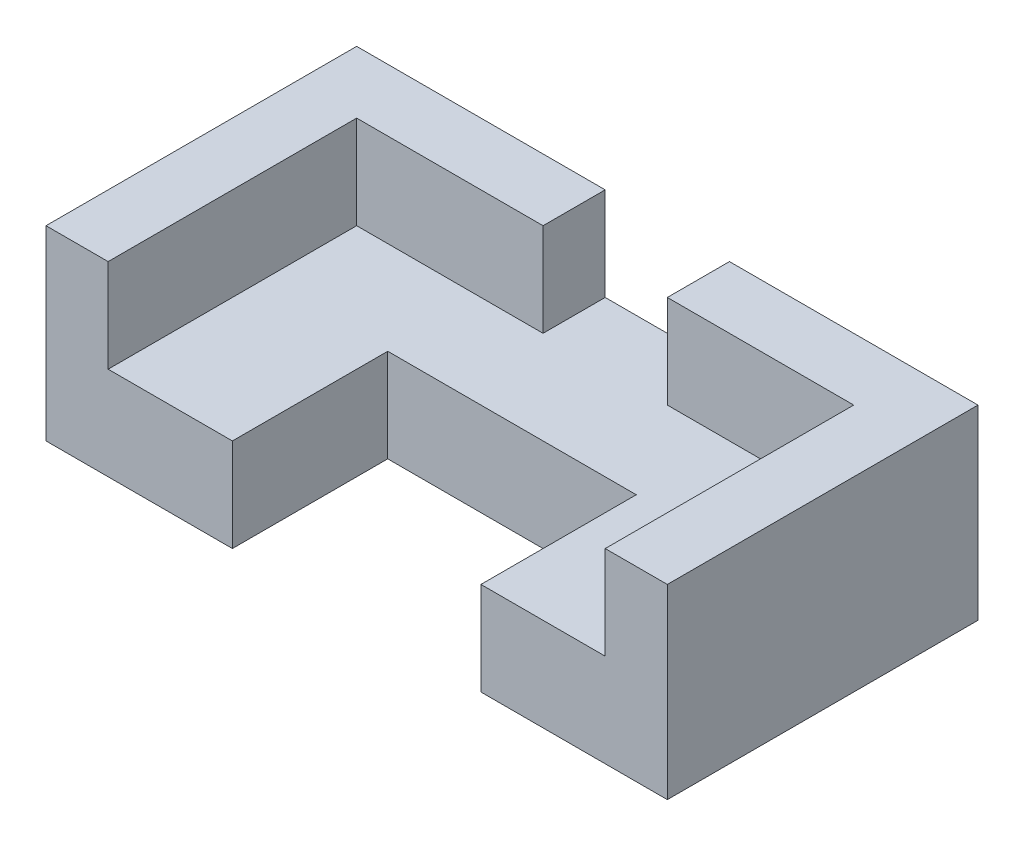
ISO-10303-21;
HEADER;
FILE_DESCRIPTION(('STEP AP214'),'2;1');
FILE_NAME('part.step','',(''),(''),'','','');
FILE_SCHEMA(('AUTOMOTIVE_DESIGN { 1 0 10303 214 1 1 1 1 }'));
ENDSEC;
DATA;
#1=APPLICATION_CONTEXT('core data for automotive mechanical design processes');
#2=APPLICATION_PROTOCOL_DEFINITION('international standard','automotive_design',2000,#1);
#3=PRODUCT_CONTEXT('',#1,'mechanical');
#4=PRODUCT('Part','Part','',(#3));
#5=PRODUCT_RELATED_PRODUCT_CATEGORY('part','',(#4));
#6=PRODUCT_DEFINITION_FORMATION('','',#4);
#7=PRODUCT_DEFINITION_CONTEXT('part definition',#1,'design');
#8=PRODUCT_DEFINITION('design','',#6,#7);
#9=PRODUCT_DEFINITION_SHAPE('','',#8);
#10=(LENGTH_UNIT() NAMED_UNIT(*) SI_UNIT(.MILLI.,.METRE.));
#11=(NAMED_UNIT(*) PLANE_ANGLE_UNIT() SI_UNIT($,.RADIAN.));
#12=(NAMED_UNIT(*) SI_UNIT($,.STERADIAN.) SOLID_ANGLE_UNIT());
#13=UNCERTAINTY_MEASURE_WITH_UNIT(LENGTH_MEASURE(1.E-05),#10,'distance_accuracy_value','');
#14=(GEOMETRIC_REPRESENTATION_CONTEXT(3) GLOBAL_UNCERTAINTY_ASSIGNED_CONTEXT((#13)) GLOBAL_UNIT_ASSIGNED_CONTEXT((#10,
#11,#12)) REPRESENTATION_CONTEXT('',''));
#15=CARTESIAN_POINT('',(0.,0.,0.));
#16=DIRECTION('',(0.,0.,1.));
#17=DIRECTION('',(1.,0.,0.));
#18=AXIS2_PLACEMENT_3D('',#15,#16,#17);
#19=CARTESIAN_POINT('',(10.,30.,-40.));
#20=DIRECTION('',(0.,0.,-1.));
#21=DIRECTION('',(-1.,0.,0.));
#22=AXIS2_PLACEMENT_3D('',#19,#20,#21);
#23=PLANE('',#22);
#24=DIRECTION('',(1.,0.,0.));
#25=VECTOR('',#24,1.);
#26=CARTESIAN_POINT('',(10.,15.,-40.));
#27=LINE('',#26,#25);
#28=CARTESIAN_POINT('',(10.,15.,-40.));
#29=VERTEX_POINT('',#28);
#30=CARTESIAN_POINT('',(40.,15.,-40.));
#31=VERTEX_POINT('',#30);
#32=EDGE_CURVE('E173',#29,#31,#27,.T.);
#33=ORIENTED_EDGE('',*,*,#32,.T.);
#34=DIRECTION('',(0.,1.,0.));
#35=VECTOR('',#34,1.);
#36=CARTESIAN_POINT('',(40.,15.,-40.));
#37=LINE('',#36,#35);
#38=CARTESIAN_POINT('',(40.,30.,-40.));
#39=VERTEX_POINT('',#38);
#40=EDGE_CURVE('E310',#31,#39,#37,.T.);
#41=ORIENTED_EDGE('',*,*,#40,.T.);
#42=DIRECTION('',(1.,0.,0.));
#43=VECTOR('',#42,1.);
#44=CARTESIAN_POINT('',(10.,30.,-40.));
#45=LINE('',#44,#43);
#46=CARTESIAN_POINT('',(10.,30.,-40.));
#47=VERTEX_POINT('',#46);
#48=EDGE_CURVE('E188',#47,#39,#45,.T.);
#49=ORIENTED_EDGE('',*,*,#48,.F.);
#50=DIRECTION('',(0.,-1.,0.));
#51=VECTOR('',#50,1.);
#52=CARTESIAN_POINT('',(10.,30.,-40.));
#53=LINE('',#52,#51);
#54=EDGE_CURVE('E187',#47,#29,#53,.T.);
#55=ORIENTED_EDGE('',*,*,#54,.T.);
#56=EDGE_LOOP('',(#33,#41,#49,#55));
#57=FACE_BOUND('',#56,.T.);
#58=ADVANCED_FACE('F39',(#57),#23,.F.);
#59=CARTESIAN_POINT('',(0.,30.,0.));
#60=DIRECTION('',(0.,1.,0.));
#61=DIRECTION('',(0.,0.,1.));
#62=AXIS2_PLACEMENT_3D('',#59,#60,#61);
#63=PLANE('',#62);
#64=DIRECTION('',(0.,0.,1.));
#65=VECTOR('',#64,1.);
#66=CARTESIAN_POINT('',(40.,30.,-40.));
#67=LINE('',#66,#65);
#68=CARTESIAN_POINT('',(40.,30.,-50.));
#69=VERTEX_POINT('',#68);
#70=EDGE_CURVE('E160',#69,#39,#67,.T.);
#71=ORIENTED_EDGE('',*,*,#70,.F.);
#72=DIRECTION('',(-1.,0.,0.));
#73=VECTOR('',#72,1.);
#74=CARTESIAN_POINT('',(100.,30.,-50.));
#75=LINE('',#74,#73);
#76=CARTESIAN_POINT('',(0.,30.,-50.));
#77=VERTEX_POINT('',#76);
#78=EDGE_CURVE('E336',#69,#77,#75,.T.);
#79=ORIENTED_EDGE('',*,*,#78,.T.);
#80=DIRECTION('',(0.,0.,1.));
#81=VECTOR('',#80,1.);
#82=CARTESIAN_POINT('',(0.,30.,-50.));
#83=LINE('',#82,#81);
#84=CARTESIAN_POINT('',(0.,30.,0.));
#85=VERTEX_POINT('',#84);
#86=EDGE_CURVE('E305',#77,#85,#83,.T.);
#87=ORIENTED_EDGE('',*,*,#86,.T.);
#88=DIRECTION('',(1.,0.,0.));
#89=VECTOR('',#88,1.);
#90=CARTESIAN_POINT('',(0.,30.,0.));
#91=LINE('',#90,#89);
#92=CARTESIAN_POINT('',(10.,30.,0.));
#93=VERTEX_POINT('',#92);
#94=EDGE_CURVE('E300',#85,#93,#91,.T.);
#95=ORIENTED_EDGE('',*,*,#94,.T.);
#96=DIRECTION('',(0.,0.,-1.));
#97=VECTOR('',#96,1.);
#98=CARTESIAN_POINT('',(10.,30.,0.));
#99=LINE('',#98,#97);
#100=EDGE_CURVE('E295',#93,#47,#99,.T.);
#101=ORIENTED_EDGE('',*,*,#100,.T.);
#102=ORIENTED_EDGE('',*,*,#48,.T.);
#103=EDGE_LOOP('',(#71,#79,#87,#95,#101,#102));
#104=FACE_BOUND('',#103,.T.);
#105=ADVANCED_FACE('F344',(#104),#63,.T.);
#106=CARTESIAN_POINT('',(0.,15.,-50.));
#107=DIRECTION('',(1.,0.,0.));
#108=DIRECTION('',(0.,0.,-1.));
#109=AXIS2_PLACEMENT_3D('',#106,#107,#108);
#110=PLANE('',#109);
#111=DIRECTION('',(0.,0.,1.));
#112=VECTOR('',#111,1.);
#113=CARTESIAN_POINT('',(0.,0.,-50.));
#114=LINE('',#113,#112);
#115=CARTESIAN_POINT('',(0.,0.,-50.));
#116=VERTEX_POINT('',#115);
#117=CARTESIAN_POINT('',(0.,0.,0.));
#118=VERTEX_POINT('',#117);
#119=EDGE_CURVE('E200',#116,#118,#114,.T.);
#120=ORIENTED_EDGE('',*,*,#119,.T.);
#121=DIRECTION('',(0.,-1.,0.));
#122=VECTOR('',#121,1.);
#123=CARTESIAN_POINT('',(0.,15.,0.));
#124=LINE('',#123,#122);
#125=EDGE_CURVE('E11',#85,#118,#124,.T.);
#126=ORIENTED_EDGE('',*,*,#125,.F.);
#127=ORIENTED_EDGE('',*,*,#86,.F.);
#128=DIRECTION('',(0.,-1.,0.));
#129=VECTOR('',#128,1.);
#130=CARTESIAN_POINT('',(0.,15.,-50.));
#131=LINE('',#130,#129);
#132=EDGE_CURVE('E217',#77,#116,#131,.T.);
#133=ORIENTED_EDGE('',*,*,#132,.T.);
#134=EDGE_LOOP('',(#120,#126,#127,#133));
#135=FACE_BOUND('',#134,.T.);
#136=ADVANCED_FACE('F41',(#135),#110,.F.);
#137=CARTESIAN_POINT('',(0.,15.,0.));
#138=DIRECTION('',(0.,0.,-1.));
#139=DIRECTION('',(-1.,0.,0.));
#140=AXIS2_PLACEMENT_3D('',#137,#138,#139);
#141=PLANE('',#140);
#142=DIRECTION('',(1.,0.,0.));
#143=VECTOR('',#142,1.);
#144=CARTESIAN_POINT('',(0.,0.,0.));
#145=LINE('',#144,#143);
#146=CARTESIAN_POINT('',(30.,0.,0.));
#147=VERTEX_POINT('',#146);
#148=EDGE_CURVE('E221',#118,#147,#145,.T.);
#149=ORIENTED_EDGE('',*,*,#148,.T.);
#150=DIRECTION('',(0.,-1.,0.));
#151=VECTOR('',#150,1.);
#152=CARTESIAN_POINT('',(30.,15.,0.));
#153=LINE('',#152,#151);
#154=CARTESIAN_POINT('',(30.,15.,0.));
#155=VERTEX_POINT('',#154);
#156=EDGE_CURVE('E48',#155,#147,#153,.T.);
#157=ORIENTED_EDGE('',*,*,#156,.F.);
#158=DIRECTION('',(1.,0.,0.));
#159=VECTOR('',#158,1.);
#160=CARTESIAN_POINT('',(0.,15.,0.));
#161=LINE('',#160,#159);
#162=CARTESIAN_POINT('',(10.,15.,0.));
#163=VERTEX_POINT('',#162);
#164=EDGE_CURVE('E201',#163,#155,#161,.T.);
#165=ORIENTED_EDGE('',*,*,#164,.F.);
#166=DIRECTION('',(0.,-1.,0.));
#167=VECTOR('',#166,1.);
#168=CARTESIAN_POINT('',(10.,30.,0.));
#169=LINE('',#168,#167);
#170=EDGE_CURVE('E192',#93,#163,#169,.T.);
#171=ORIENTED_EDGE('',*,*,#170,.F.);
#172=ORIENTED_EDGE('',*,*,#94,.F.);
#173=ORIENTED_EDGE('',*,*,#125,.T.);
#174=EDGE_LOOP('',(#149,#157,#165,#171,#172,#173));
#175=FACE_BOUND('',#174,.T.);
#176=ADVANCED_FACE('F289',(#175),#141,.F.);
#177=CARTESIAN_POINT('',(30.,15.,0.));
#178=DIRECTION('',(-1.,0.,0.));
#179=DIRECTION('',(0.,0.,1.));
#180=AXIS2_PLACEMENT_3D('',#177,#178,#179);
#181=PLANE('',#180);
#182=DIRECTION('',(0.,0.,-1.));
#183=VECTOR('',#182,1.);
#184=CARTESIAN_POINT('',(30.,0.,0.));
#185=LINE('',#184,#183);
#186=CARTESIAN_POINT('',(30.,0.,-25.));
#187=VERTEX_POINT('',#186);
#188=EDGE_CURVE('E224',#147,#187,#185,.T.);
#189=ORIENTED_EDGE('',*,*,#188,.T.);
#190=DIRECTION('',(0.,-1.,0.));
#191=VECTOR('',#190,1.);
#192=CARTESIAN_POINT('',(30.,15.,-25.));
#193=LINE('',#192,#191);
#194=CARTESIAN_POINT('',(30.,15.,-25.));
#195=VERTEX_POINT('',#194);
#196=EDGE_CURVE('E260',#195,#187,#193,.T.);
#197=ORIENTED_EDGE('',*,*,#196,.F.);
#198=DIRECTION('',(0.,0.,-1.));
#199=VECTOR('',#198,1.);
#200=CARTESIAN_POINT('',(30.,15.,0.));
#201=LINE('',#200,#199);
#202=EDGE_CURVE('E204',#155,#195,#201,.T.);
#203=ORIENTED_EDGE('',*,*,#202,.F.);
#204=ORIENTED_EDGE('',*,*,#156,.T.);
#205=EDGE_LOOP('',(#189,#197,#203,#204));
#206=FACE_BOUND('',#205,.T.);
#207=ADVANCED_FACE('F269',(#206),#181,.F.);
#208=CARTESIAN_POINT('',(30.,15.,-25.));
#209=DIRECTION('',(0.,0.,-1.));
#210=DIRECTION('',(-1.,0.,0.));
#211=AXIS2_PLACEMENT_3D('',#208,#209,#210);
#212=PLANE('',#211);
#213=DIRECTION('',(1.,0.,0.));
#214=VECTOR('',#213,1.);
#215=CARTESIAN_POINT('',(30.,0.,-25.));
#216=LINE('',#215,#214);
#217=CARTESIAN_POINT('',(70.,0.,-25.));
#218=VERTEX_POINT('',#217);
#219=EDGE_CURVE('E227',#187,#218,#216,.T.);
#220=ORIENTED_EDGE('',*,*,#219,.T.);
#221=DIRECTION('',(0.,-1.,0.));
#222=VECTOR('',#221,1.);
#223=CARTESIAN_POINT('',(70.,15.,-25.));
#224=LINE('',#223,#222);
#225=CARTESIAN_POINT('',(70.,15.,-25.));
#226=VERTEX_POINT('',#225);
#227=EDGE_CURVE('E256',#226,#218,#224,.T.);
#228=ORIENTED_EDGE('',*,*,#227,.F.);
#229=DIRECTION('',(1.,0.,0.));
#230=VECTOR('',#229,1.);
#231=CARTESIAN_POINT('',(30.,15.,-25.));
#232=LINE('',#231,#230);
#233=EDGE_CURVE('E208',#195,#226,#232,.T.);
#234=ORIENTED_EDGE('',*,*,#233,.F.);
#235=ORIENTED_EDGE('',*,*,#196,.T.);
#236=EDGE_LOOP('',(#220,#228,#234,#235));
#237=FACE_BOUND('',#236,.T.);
#238=ADVANCED_FACE('F281',(#237),#212,.F.);
#239=CARTESIAN_POINT('',(70.,15.,-25.));
#240=DIRECTION('',(1.,0.,0.));
#241=DIRECTION('',(0.,0.,-1.));
#242=AXIS2_PLACEMENT_3D('',#239,#240,#241);
#243=PLANE('',#242);
#244=DIRECTION('',(0.,0.,1.));
#245=VECTOR('',#244,1.);
#246=CARTESIAN_POINT('',(70.,0.,-25.));
#247=LINE('',#246,#245);
#248=CARTESIAN_POINT('',(70.,0.,0.));
#249=VERTEX_POINT('',#248);
#250=EDGE_CURVE('E230',#218,#249,#247,.T.);
#251=ORIENTED_EDGE('',*,*,#250,.T.);
#252=DIRECTION('',(0.,-1.,0.));
#253=VECTOR('',#252,1.);
#254=CARTESIAN_POINT('',(70.,15.,0.));
#255=LINE('',#254,#253);
#256=CARTESIAN_POINT('',(70.,15.,0.));
#257=VERTEX_POINT('',#256);
#258=EDGE_CURVE('E252',#257,#249,#255,.T.);
#259=ORIENTED_EDGE('',*,*,#258,.F.);
#260=DIRECTION('',(0.,0.,1.));
#261=VECTOR('',#260,1.);
#262=CARTESIAN_POINT('',(70.,15.,-25.));
#263=LINE('',#262,#261);
#264=EDGE_CURVE('E211',#226,#257,#263,.T.);
#265=ORIENTED_EDGE('',*,*,#264,.F.);
#266=ORIENTED_EDGE('',*,*,#227,.T.);
#267=EDGE_LOOP('',(#251,#259,#265,#266));
#268=FACE_BOUND('',#267,.T.);
#269=ADVANCED_FACE('F285',(#268),#243,.F.);
#270=CARTESIAN_POINT('',(70.,15.,0.));
#271=DIRECTION('',(0.,0.,-1.));
#272=DIRECTION('',(-1.,0.,0.));
#273=AXIS2_PLACEMENT_3D('',#270,#271,#272);
#274=PLANE('',#273);
#275=DIRECTION('',(1.,0.,0.));
#276=VECTOR('',#275,1.);
#277=CARTESIAN_POINT('',(70.,0.,0.));
#278=LINE('',#277,#276);
#279=CARTESIAN_POINT('',(100.,0.,0.));
#280=VERTEX_POINT('',#279);
#281=EDGE_CURVE('E233',#249,#280,#278,.T.);
#282=ORIENTED_EDGE('',*,*,#281,.T.);
#283=DIRECTION('',(0.,-1.,0.));
#284=VECTOR('',#283,1.);
#285=CARTESIAN_POINT('',(100.,15.,0.));
#286=LINE('',#285,#284);
#287=CARTESIAN_POINT('',(100.,30.,0.));
#288=VERTEX_POINT('',#287);
#289=EDGE_CURVE('E248',#288,#280,#286,.T.);
#290=ORIENTED_EDGE('',*,*,#289,.F.);
#291=DIRECTION('',(1.,0.,0.));
#292=VECTOR('',#291,1.);
#293=CARTESIAN_POINT('',(90.,30.,0.));
#294=LINE('',#293,#292);
#295=CARTESIAN_POINT('',(90.,30.,0.));
#296=VERTEX_POINT('',#295);
#297=EDGE_CURVE('E328',#296,#288,#294,.T.);
#298=ORIENTED_EDGE('',*,*,#297,.F.);
#299=DIRECTION('',(0.,-1.,0.));
#300=VECTOR('',#299,1.);
#301=CARTESIAN_POINT('',(90.,30.,0.));
#302=LINE('',#301,#300);
#303=CARTESIAN_POINT('',(90.,15.,0.));
#304=VERTEX_POINT('',#303);
#305=EDGE_CURVE('E196',#296,#304,#302,.T.);
#306=ORIENTED_EDGE('',*,*,#305,.T.);
#307=DIRECTION('',(1.,0.,0.));
#308=VECTOR('',#307,1.);
#309=CARTESIAN_POINT('',(70.,15.,0.));
#310=LINE('',#309,#308);
#311=EDGE_CURVE('E214',#257,#304,#310,.T.);
#312=ORIENTED_EDGE('',*,*,#311,.F.);
#313=ORIENTED_EDGE('',*,*,#258,.T.);
#314=EDGE_LOOP('',(#282,#290,#298,#306,#312,#313));
#315=FACE_BOUND('',#314,.T.);
#316=ADVANCED_FACE('F360',(#315),#274,.F.);
#317=CARTESIAN_POINT('',(100.,15.,0.));
#318=DIRECTION('',(-1.,0.,0.));
#319=DIRECTION('',(0.,0.,1.));
#320=AXIS2_PLACEMENT_3D('',#317,#318,#319);
#321=PLANE('',#320);
#322=DIRECTION('',(0.,0.,-1.));
#323=VECTOR('',#322,1.);
#324=CARTESIAN_POINT('',(100.,0.,0.));
#325=LINE('',#324,#323);
#326=CARTESIAN_POINT('',(100.,0.,-50.));
#327=VERTEX_POINT('',#326);
#328=EDGE_CURVE('E236',#280,#327,#325,.T.);
#329=ORIENTED_EDGE('',*,*,#328,.T.);
#330=DIRECTION('',(0.,-1.,0.));
#331=VECTOR('',#330,1.);
#332=CARTESIAN_POINT('',(100.,15.,-50.));
#333=LINE('',#332,#331);
#334=CARTESIAN_POINT('',(100.,30.,-50.));
#335=VERTEX_POINT('',#334);
#336=EDGE_CURVE('E244',#335,#327,#333,.T.);
#337=ORIENTED_EDGE('',*,*,#336,.F.);
#338=DIRECTION('',(0.,0.,-1.));
#339=VECTOR('',#338,1.);
#340=CARTESIAN_POINT('',(100.,30.,0.));
#341=LINE('',#340,#339);
#342=EDGE_CURVE('E332',#288,#335,#341,.T.);
#343=ORIENTED_EDGE('',*,*,#342,.F.);
#344=ORIENTED_EDGE('',*,*,#289,.T.);
#345=EDGE_LOOP('',(#329,#337,#343,#344));
#346=FACE_BOUND('',#345,.T.);
#347=ADVANCED_FACE('F355',(#346),#321,.F.);
#348=CARTESIAN_POINT('',(100.,15.,-50.));
#349=DIRECTION('',(0.,0.,1.));
#350=DIRECTION('',(1.,0.,0.));
#351=AXIS2_PLACEMENT_3D('',#348,#349,#350);
#352=PLANE('',#351);
#353=ORIENTED_EDGE('',*,*,#78,.F.);
#354=DIRECTION('',(0.,1.,0.));
#355=VECTOR('',#354,1.);
#356=CARTESIAN_POINT('',(40.,15.,-50.));
#357=LINE('',#356,#355);
#358=CARTESIAN_POINT('',(40.,15.,-50.));
#359=VERTEX_POINT('',#358);
#360=EDGE_CURVE('E315',#359,#69,#357,.T.);
#361=ORIENTED_EDGE('',*,*,#360,.F.);
#362=DIRECTION('',(-1.,0.,0.));
#363=VECTOR('',#362,1.);
#364=CARTESIAN_POINT('',(40.,15.,-50.));
#365=LINE('',#364,#363);
#366=CARTESIAN_POINT('',(60.,15.,-50.));
#367=VERTEX_POINT('',#366);
#368=EDGE_CURVE('E159',#367,#359,#365,.T.);
#369=ORIENTED_EDGE('',*,*,#368,.F.);
#370=DIRECTION('',(0.,1.,0.));
#371=VECTOR('',#370,1.);
#372=CARTESIAN_POINT('',(60.,15.,-50.));
#373=LINE('',#372,#371);
#374=CARTESIAN_POINT('',(60.,30.,-50.));
#375=VERTEX_POINT('',#374);
#376=EDGE_CURVE('E155',#367,#375,#373,.T.);
#377=ORIENTED_EDGE('',*,*,#376,.T.);
#378=EDGE_CURVE('E337',#335,#375,#75,.T.);
#379=ORIENTED_EDGE('',*,*,#378,.F.);
#380=ORIENTED_EDGE('',*,*,#336,.T.);
#381=DIRECTION('',(-1.,0.,0.));
#382=VECTOR('',#381,1.);
#383=CARTESIAN_POINT('',(100.,0.,-50.));
#384=LINE('',#383,#382);
#385=EDGE_CURVE('E205',#327,#116,#384,.T.);
#386=ORIENTED_EDGE('',*,*,#385,.T.);
#387=ORIENTED_EDGE('',*,*,#132,.F.);
#388=EDGE_LOOP('',(#353,#361,#369,#377,#379,#380,#386,#387));
#389=FACE_BOUND('',#388,.T.);
#390=ADVANCED_FACE('F351',(#389),#352,.F.);
#391=CARTESIAN_POINT('',(0.,15.,0.));
#392=DIRECTION('',(0.,1.,0.));
#393=DIRECTION('',(0.,0.,1.));
#394=AXIS2_PLACEMENT_3D('',#391,#392,#393);
#395=PLANE('',#394);
#396=DIRECTION('',(0.,0.,1.));
#397=VECTOR('',#396,1.);
#398=CARTESIAN_POINT('',(90.,15.,-40.));
#399=LINE('',#398,#397);
#400=CARTESIAN_POINT('',(90.,15.,-40.));
#401=VERTEX_POINT('',#400);
#402=EDGE_CURVE('E170',#401,#304,#399,.T.);
#403=ORIENTED_EDGE('',*,*,#402,.F.);
#404=CARTESIAN_POINT('',(60.,15.,-40.));
#405=VERTEX_POINT('',#404);
#406=EDGE_CURVE('E62',#405,#401,#27,.T.);
#407=ORIENTED_EDGE('',*,*,#406,.F.);
#408=DIRECTION('',(0.,0.,-1.));
#409=VECTOR('',#408,1.);
#410=CARTESIAN_POINT('',(60.,15.,-50.));
#411=LINE('',#410,#409);
#412=EDGE_CURVE('E152',#405,#367,#411,.T.);
#413=ORIENTED_EDGE('',*,*,#412,.T.);
#414=ORIENTED_EDGE('',*,*,#368,.T.);
#415=DIRECTION('',(0.,0.,1.));
#416=VECTOR('',#415,1.);
#417=CARTESIAN_POINT('',(40.,15.,-40.));
#418=LINE('',#417,#416);
#419=EDGE_CURVE('E166',#359,#31,#418,.T.);
#420=ORIENTED_EDGE('',*,*,#419,.T.);
#421=ORIENTED_EDGE('',*,*,#32,.F.);
#422=DIRECTION('',(0.,0.,-1.));
#423=VECTOR('',#422,1.);
#424=CARTESIAN_POINT('',(10.,15.,0.));
#425=LINE('',#424,#423);
#426=EDGE_CURVE('E174',#163,#29,#425,.T.);
#427=ORIENTED_EDGE('',*,*,#426,.F.);
#428=ORIENTED_EDGE('',*,*,#164,.T.);
#429=ORIENTED_EDGE('',*,*,#202,.T.);
#430=ORIENTED_EDGE('',*,*,#233,.T.);
#431=ORIENTED_EDGE('',*,*,#264,.T.);
#432=ORIENTED_EDGE('',*,*,#311,.T.);
#433=EDGE_LOOP('',(#403,#407,#413,#414,#420,#421,#427,#428,#429,#430,#431,#432));
#434=FACE_BOUND('',#433,.T.);
#435=ADVANCED_FACE('F168',(#434),#395,.T.);
#436=CARTESIAN_POINT('',(0.,0.,0.));
#437=DIRECTION('',(0.,1.,0.));
#438=DIRECTION('',(0.,0.,1.));
#439=AXIS2_PLACEMENT_3D('',#436,#437,#438);
#440=PLANE('',#439);
#441=ORIENTED_EDGE('',*,*,#119,.F.);
#442=ORIENTED_EDGE('',*,*,#385,.F.);
#443=ORIENTED_EDGE('',*,*,#328,.F.);
#444=ORIENTED_EDGE('',*,*,#281,.F.);
#445=ORIENTED_EDGE('',*,*,#250,.F.);
#446=ORIENTED_EDGE('',*,*,#219,.F.);
#447=ORIENTED_EDGE('',*,*,#188,.F.);
#448=ORIENTED_EDGE('',*,*,#148,.F.);
#449=EDGE_LOOP('',(#441,#442,#443,#444,#445,#446,#447,#448));
#450=FACE_BOUND('',#449,.T.);
#451=ADVANCED_FACE('F276',(#450),#440,.F.);
#452=CARTESIAN_POINT('',(90.,30.,-40.));
#453=DIRECTION('',(1.,0.,0.));
#454=DIRECTION('',(0.,0.,-1.));
#455=AXIS2_PLACEMENT_3D('',#452,#453,#454);
#456=PLANE('',#455);
#457=ORIENTED_EDGE('',*,*,#402,.T.);
#458=ORIENTED_EDGE('',*,*,#305,.F.);
#459=DIRECTION('',(0.,0.,1.));
#460=VECTOR('',#459,1.);
#461=CARTESIAN_POINT('',(90.,30.,-40.));
#462=LINE('',#461,#460);
#463=CARTESIAN_POINT('',(90.,30.,-40.));
#464=VERTEX_POINT('',#463);
#465=EDGE_CURVE('E179',#464,#296,#462,.T.);
#466=ORIENTED_EDGE('',*,*,#465,.F.);
#467=DIRECTION('',(0.,-1.,0.));
#468=VECTOR('',#467,1.);
#469=CARTESIAN_POINT('',(90.,30.,-40.));
#470=LINE('',#469,#468);
#471=EDGE_CURVE('E184',#464,#401,#470,.T.);
#472=ORIENTED_EDGE('',*,*,#471,.T.);
#473=EDGE_LOOP('',(#457,#458,#466,#472));
#474=FACE_BOUND('',#473,.T.);
#475=ADVANCED_FACE('F361',(#474),#456,.F.);
#476=CARTESIAN_POINT('',(10.,30.,0.));
#477=DIRECTION('',(-1.,0.,0.));
#478=DIRECTION('',(0.,0.,1.));
#479=AXIS2_PLACEMENT_3D('',#476,#477,#478);
#480=PLANE('',#479);
#481=ORIENTED_EDGE('',*,*,#426,.T.);
#482=ORIENTED_EDGE('',*,*,#54,.F.);
#483=ORIENTED_EDGE('',*,*,#100,.F.);
#484=ORIENTED_EDGE('',*,*,#170,.T.);
#485=EDGE_LOOP('',(#481,#482,#483,#484));
#486=FACE_BOUND('',#485,.T.);
#487=ADVANCED_FACE('F293',(#486),#480,.F.);
#488=CARTESIAN_POINT('',(60.,30.,-40.));
#489=VERTEX_POINT('',#488);
#490=EDGE_CURVE('E164',#489,#464,#45,.T.);
#491=ORIENTED_EDGE('',*,*,#490,.F.);
#492=DIRECTION('',(0.,1.,0.));
#493=VECTOR('',#492,1.);
#494=CARTESIAN_POINT('',(60.,15.,-40.));
#495=LINE('',#494,#493);
#496=EDGE_CURVE('E55',#405,#489,#495,.T.);
#497=ORIENTED_EDGE('',*,*,#496,.F.);
#498=ORIENTED_EDGE('',*,*,#406,.T.);
#499=ORIENTED_EDGE('',*,*,#471,.F.);
#500=EDGE_LOOP('',(#491,#497,#498,#499));
#501=FACE_BOUND('',#500,.T.);
#502=ADVANCED_FACE('F163',(#501),#23,.F.);
#503=DIRECTION('',(0.,0.,-1.));
#504=VECTOR('',#503,1.);
#505=CARTESIAN_POINT('',(60.,30.,-50.));
#506=LINE('',#505,#504);
#507=EDGE_CURVE('E526',#489,#375,#506,.T.);
#508=ORIENTED_EDGE('',*,*,#507,.F.);
#509=ORIENTED_EDGE('',*,*,#490,.T.);
#510=ORIENTED_EDGE('',*,*,#465,.T.);
#511=ORIENTED_EDGE('',*,*,#297,.T.);
#512=ORIENTED_EDGE('',*,*,#342,.T.);
#513=ORIENTED_EDGE('',*,*,#378,.T.);
#514=EDGE_LOOP('',(#508,#509,#510,#511,#512,#513));
#515=FACE_BOUND('',#514,.T.);
#516=ADVANCED_FACE('F357',(#515),#63,.T.);
#517=CARTESIAN_POINT('',(40.,15.,-40.));
#518=DIRECTION('',(-1.,0.,0.));
#519=DIRECTION('',(0.,0.,1.));
#520=AXIS2_PLACEMENT_3D('',#517,#518,#519);
#521=PLANE('',#520);
#522=ORIENTED_EDGE('',*,*,#70,.T.);
#523=ORIENTED_EDGE('',*,*,#40,.F.);
#524=ORIENTED_EDGE('',*,*,#419,.F.);
#525=ORIENTED_EDGE('',*,*,#360,.T.);
#526=EDGE_LOOP('',(#522,#523,#524,#525));
#527=FACE_BOUND('',#526,.T.);
#528=ADVANCED_FACE('F381',(#527),#521,.F.);
#529=CARTESIAN_POINT('',(60.,15.,-50.));
#530=DIRECTION('',(1.,0.,0.));
#531=DIRECTION('',(0.,0.,-1.));
#532=AXIS2_PLACEMENT_3D('',#529,#530,#531);
#533=PLANE('',#532);
#534=ORIENTED_EDGE('',*,*,#507,.T.);
#535=ORIENTED_EDGE('',*,*,#376,.F.);
#536=ORIENTED_EDGE('',*,*,#412,.F.);
#537=ORIENTED_EDGE('',*,*,#496,.T.);
#538=EDGE_LOOP('',(#534,#535,#536,#537));
#539=FACE_BOUND('',#538,.T.);
#540=ADVANCED_FACE('F153',(#539),#533,.F.);
#541=CLOSED_SHELL('',(#58,#105,#136,#176,#207,#238,#269,#316,#347,#390,#435,#451,#475,#487,#502,
#516,#528,#540));
#542=MANIFOLD_SOLID_BREP('B2',#541);
#543=ADVANCED_BREP_SHAPE_REPRESENTATION('',(#18,#542),#14);
#544=SHAPE_DEFINITION_REPRESENTATION(#9,#543);
ENDSEC;
END-ISO-10303-21;
